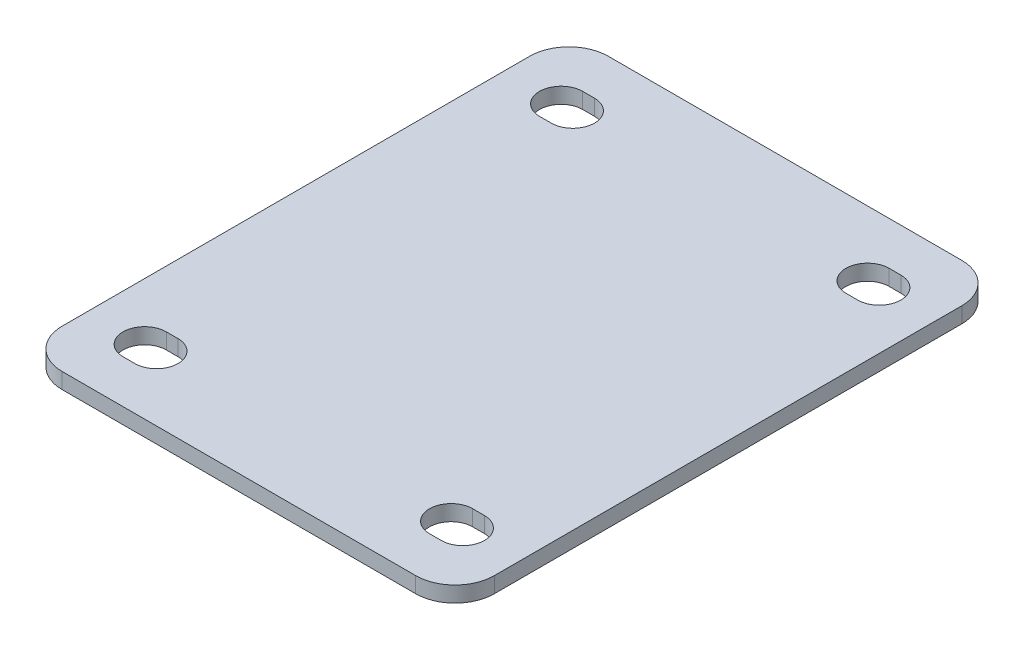
ISO-10303-21;
HEADER;
FILE_DESCRIPTION(('STEP AP214'),'2;1');
FILE_NAME('part.step','',(''),(''),'','','');
FILE_SCHEMA(('AUTOMOTIVE_DESIGN { 1 0 10303 214 1 1 1 1 }'));
ENDSEC;
DATA;
#1=APPLICATION_CONTEXT('core data for automotive mechanical design processes');
#2=APPLICATION_PROTOCOL_DEFINITION('international standard','automotive_design',2000,#1);
#3=PRODUCT_CONTEXT('',#1,'mechanical');
#4=PRODUCT('Part','Part','',(#3));
#5=PRODUCT_RELATED_PRODUCT_CATEGORY('part','',(#4));
#6=PRODUCT_DEFINITION_FORMATION('','',#4);
#7=PRODUCT_DEFINITION_CONTEXT('part definition',#1,'design');
#8=PRODUCT_DEFINITION('design','',#6,#7);
#9=PRODUCT_DEFINITION_SHAPE('','',#8);
#10=(LENGTH_UNIT() NAMED_UNIT(*) SI_UNIT(.MILLI.,.METRE.));
#11=(NAMED_UNIT(*) PLANE_ANGLE_UNIT() SI_UNIT($,.RADIAN.));
#12=(NAMED_UNIT(*) SI_UNIT($,.STERADIAN.) SOLID_ANGLE_UNIT());
#13=UNCERTAINTY_MEASURE_WITH_UNIT(LENGTH_MEASURE(1.E-05),#10,'distance_accuracy_value','');
#14=(GEOMETRIC_REPRESENTATION_CONTEXT(3) GLOBAL_UNCERTAINTY_ASSIGNED_CONTEXT((#13)) GLOBAL_UNIT_ASSIGNED_CONTEXT((#10,
#11,#12)) REPRESENTATION_CONTEXT('',''));
#15=CARTESIAN_POINT('',(0.,0.,0.));
#16=DIRECTION('',(0.,0.,1.));
#17=DIRECTION('',(1.,0.,0.));
#18=AXIS2_PLACEMENT_3D('',#15,#16,#17);
#19=CARTESIAN_POINT('',(0.,4.,0.));
#20=DIRECTION('',(0.,1.,0.));
#21=DIRECTION('',(0.,0.,1.));
#22=AXIS2_PLACEMENT_3D('',#19,#20,#21);
#23=PLANE('',#22);
#24=DIRECTION('',(-1.,0.,0.));
#25=VECTOR('',#24,1.);
#26=CARTESIAN_POINT('',(-55.,4.,-69.5));
#27=LINE('',#26,#25);
#28=CARTESIAN_POINT('',(45.,4.,-69.5));
#29=VERTEX_POINT('',#28);
#30=CARTESIAN_POINT('',(-45.,4.,-69.5));
#31=VERTEX_POINT('',#30);
#32=EDGE_CURVE('E334',#29,#31,#27,.T.);
#33=ORIENTED_EDGE('',*,*,#32,.T.);
#34=CARTESIAN_POINT('',(-45.,4.,-59.5));
#35=DIRECTION('',(0.,1.,0.));
#36=DIRECTION('',(0.,0.,1.));
#37=AXIS2_PLACEMENT_3D('',#34,#35,#36);
#38=CIRCLE('',#37,10.);
#39=CARTESIAN_POINT('',(-55.,4.,-59.5));
#40=VERTEX_POINT('',#39);
#41=EDGE_CURVE('E374',#31,#40,#38,.T.);
#42=ORIENTED_EDGE('',*,*,#41,.T.);
#43=DIRECTION('',(0.,0.,1.));
#44=VECTOR('',#43,1.);
#45=CARTESIAN_POINT('',(-55.,4.,-69.5));
#46=LINE('',#45,#44);
#47=CARTESIAN_POINT('',(-55.,4.,59.5));
#48=VERTEX_POINT('',#47);
#49=EDGE_CURVE('E338',#40,#48,#46,.T.);
#50=ORIENTED_EDGE('',*,*,#49,.T.);
#51=CARTESIAN_POINT('',(-45.,4.,59.5));
#52=DIRECTION('',(0.,1.,0.));
#53=DIRECTION('',(0.,0.,1.));
#54=AXIS2_PLACEMENT_3D('',#51,#52,#53);
#55=CIRCLE('',#54,10.);
#56=CARTESIAN_POINT('',(-45.,4.,69.5));
#57=VERTEX_POINT('',#56);
#58=EDGE_CURVE('E55',#48,#57,#55,.T.);
#59=ORIENTED_EDGE('',*,*,#58,.T.);
#60=DIRECTION('',(1.,0.,0.));
#61=VECTOR('',#60,1.);
#62=CARTESIAN_POINT('',(-55.,4.,69.5));
#63=LINE('',#62,#61);
#64=CARTESIAN_POINT('',(45.,4.,69.5));
#65=VERTEX_POINT('',#64);
#66=EDGE_CURVE('E340',#57,#65,#63,.T.);
#67=ORIENTED_EDGE('',*,*,#66,.T.);
#68=CARTESIAN_POINT('',(45.,4.,59.5));
#69=DIRECTION('',(0.,1.,0.));
#70=DIRECTION('',(0.,0.,1.));
#71=AXIS2_PLACEMENT_3D('',#68,#69,#70);
#72=CIRCLE('',#71,10.);
#73=CARTESIAN_POINT('',(55.,4.,59.5));
#74=VERTEX_POINT('',#73);
#75=EDGE_CURVE('E370',#65,#74,#72,.T.);
#76=ORIENTED_EDGE('',*,*,#75,.T.);
#77=DIRECTION('',(0.,0.,-1.));
#78=VECTOR('',#77,1.);
#79=CARTESIAN_POINT('',(55.,4.,-69.5));
#80=LINE('',#79,#78);
#81=CARTESIAN_POINT('',(55.,4.,-59.5));
#82=VERTEX_POINT('',#81);
#83=EDGE_CURVE('E331',#74,#82,#80,.T.);
#84=ORIENTED_EDGE('',*,*,#83,.T.);
#85=CARTESIAN_POINT('',(45.,4.,-59.5));
#86=DIRECTION('',(0.,1.,0.));
#87=DIRECTION('',(0.,0.,1.));
#88=AXIS2_PLACEMENT_3D('',#85,#86,#87);
#89=CIRCLE('',#88,10.);
#90=EDGE_CURVE('E372',#82,#29,#89,.T.);
#91=ORIENTED_EDGE('',*,*,#90,.T.);
#92=EDGE_LOOP('',(#33,#42,#50,#59,#67,#76,#84,#91));
#93=FACE_BOUND('',#92,.T.);
#94=DIRECTION('',(1.,0.,0.));
#95=VECTOR('',#94,1.);
#96=CARTESIAN_POINT('',(-40.5,4.,-47.5));
#97=LINE('',#96,#95);
#98=CARTESIAN_POINT('',(-40.5,4.,-47.5));
#99=VERTEX_POINT('',#98);
#100=CARTESIAN_POINT('',(-37.5,4.,-47.5));
#101=VERTEX_POINT('',#100);
#102=EDGE_CURVE('E302',#99,#101,#97,.T.);
#103=ORIENTED_EDGE('',*,*,#102,.F.);
#104=CARTESIAN_POINT('',(-40.5,4.,-53.));
#105=DIRECTION('',(0.,1.,0.));
#106=DIRECTION('',(0.,0.,1.));
#107=AXIS2_PLACEMENT_3D('',#104,#105,#106);
#108=CIRCLE('',#107,5.49999999999998);
#109=CARTESIAN_POINT('',(-40.5,4.,-58.5));
#110=VERTEX_POINT('',#109);
#111=EDGE_CURVE('E300',#110,#99,#108,.T.);
#112=ORIENTED_EDGE('',*,*,#111,.F.);
#113=DIRECTION('',(-1.,0.,0.));
#114=VECTOR('',#113,1.);
#115=CARTESIAN_POINT('',(-40.5,4.,-58.5));
#116=LINE('',#115,#114);
#117=CARTESIAN_POINT('',(-37.5,4.,-58.5));
#118=VERTEX_POINT('',#117);
#119=EDGE_CURVE('E308',#118,#110,#116,.T.);
#120=ORIENTED_EDGE('',*,*,#119,.F.);
#121=CARTESIAN_POINT('',(-37.5,4.,-53.));
#122=DIRECTION('',(0.,1.,0.));
#123=DIRECTION('',(0.,0.,1.));
#124=AXIS2_PLACEMENT_3D('',#121,#122,#123);
#125=CIRCLE('',#124,5.49999999999998);
#126=EDGE_CURVE('E305',#101,#118,#125,.T.);
#127=ORIENTED_EDGE('',*,*,#126,.F.);
#128=EDGE_LOOP('',(#103,#112,#120,#127));
#129=FACE_BOUND('',#128,.T.);
#130=DIRECTION('',(1.,0.,0.));
#131=VECTOR('',#130,1.);
#132=CARTESIAN_POINT('',(37.5,4.,-47.5));
#133=LINE('',#132,#131);
#134=CARTESIAN_POINT('',(37.5,4.,-47.5));
#135=VERTEX_POINT('',#134);
#136=CARTESIAN_POINT('',(40.5,4.,-47.5));
#137=VERTEX_POINT('',#136);
#138=EDGE_CURVE('E271',#135,#137,#133,.T.);
#139=ORIENTED_EDGE('',*,*,#138,.F.);
#140=CARTESIAN_POINT('',(37.5,4.,-53.));
#141=DIRECTION('',(0.,1.,0.));
#142=DIRECTION('',(0.,0.,1.));
#143=AXIS2_PLACEMENT_3D('',#140,#141,#142);
#144=CIRCLE('',#143,5.49999999999998);
#145=CARTESIAN_POINT('',(37.5,4.,-58.5));
#146=VERTEX_POINT('',#145);
#147=EDGE_CURVE('E269',#146,#135,#144,.T.);
#148=ORIENTED_EDGE('',*,*,#147,.F.);
#149=DIRECTION('',(-1.,0.,0.));
#150=VECTOR('',#149,1.);
#151=CARTESIAN_POINT('',(37.5,4.,-58.5));
#152=LINE('',#151,#150);
#153=CARTESIAN_POINT('',(40.5,4.,-58.5));
#154=VERTEX_POINT('',#153);
#155=EDGE_CURVE('E277',#154,#146,#152,.T.);
#156=ORIENTED_EDGE('',*,*,#155,.F.);
#157=CARTESIAN_POINT('',(40.5,4.,-53.));
#158=DIRECTION('',(0.,1.,0.));
#159=DIRECTION('',(0.,0.,1.));
#160=AXIS2_PLACEMENT_3D('',#157,#158,#159);
#161=CIRCLE('',#160,5.49999999999998);
#162=EDGE_CURVE('E274',#137,#154,#161,.T.);
#163=ORIENTED_EDGE('',*,*,#162,.F.);
#164=EDGE_LOOP('',(#139,#148,#156,#163));
#165=FACE_BOUND('',#164,.T.);
#166=DIRECTION('',(1.,0.,0.));
#167=VECTOR('',#166,1.);
#168=CARTESIAN_POINT('',(-40.4999999999989,4.,58.5));
#169=LINE('',#168,#167);
#170=CARTESIAN_POINT('',(-40.4999999999989,4.,58.5));
#171=VERTEX_POINT('',#170);
#172=CARTESIAN_POINT('',(-37.4999999999989,4.,58.5));
#173=VERTEX_POINT('',#172);
#174=EDGE_CURVE('E240',#171,#173,#169,.T.);
#175=ORIENTED_EDGE('',*,*,#174,.F.);
#176=CARTESIAN_POINT('',(-40.4999999999989,4.,53.));
#177=DIRECTION('',(0.,1.,0.));
#178=DIRECTION('',(0.,0.,1.));
#179=AXIS2_PLACEMENT_3D('',#176,#177,#178);
#180=CIRCLE('',#179,5.5);
#181=CARTESIAN_POINT('',(-40.4999999999989,4.,47.5));
#182=VERTEX_POINT('',#181);
#183=EDGE_CURVE('E238',#182,#171,#180,.T.);
#184=ORIENTED_EDGE('',*,*,#183,.F.);
#185=DIRECTION('',(-1.,0.,0.));
#186=VECTOR('',#185,1.);
#187=CARTESIAN_POINT('',(-40.4999999999989,4.,47.5));
#188=LINE('',#187,#186);
#189=CARTESIAN_POINT('',(-37.4999999999989,4.,47.5));
#190=VERTEX_POINT('',#189);
#191=EDGE_CURVE('E246',#190,#182,#188,.T.);
#192=ORIENTED_EDGE('',*,*,#191,.F.);
#193=CARTESIAN_POINT('',(-37.4999999999989,4.,53.));
#194=DIRECTION('',(0.,1.,0.));
#195=DIRECTION('',(0.,0.,1.));
#196=AXIS2_PLACEMENT_3D('',#193,#194,#195);
#197=CIRCLE('',#196,5.5);
#198=EDGE_CURVE('E243',#173,#190,#197,.T.);
#199=ORIENTED_EDGE('',*,*,#198,.F.);
#200=EDGE_LOOP('',(#175,#184,#192,#199));
#201=FACE_BOUND('',#200,.T.);
#202=DIRECTION('',(1.,0.,0.));
#203=VECTOR('',#202,1.);
#204=CARTESIAN_POINT('',(37.5000000000011,4.,58.5));
#205=LINE('',#204,#203);
#206=CARTESIAN_POINT('',(37.5000000000011,4.,58.5));
#207=VERTEX_POINT('',#206);
#208=CARTESIAN_POINT('',(40.5000000000011,4.,58.5));
#209=VERTEX_POINT('',#208);
#210=EDGE_CURVE('E207',#207,#209,#205,.T.);
#211=ORIENTED_EDGE('',*,*,#210,.F.);
#212=CARTESIAN_POINT('',(37.5000000000011,4.,53.));
#213=DIRECTION('',(0.,1.,0.));
#214=DIRECTION('',(0.,0.,1.));
#215=AXIS2_PLACEMENT_3D('',#212,#213,#214);
#216=CIRCLE('',#215,5.5);
#217=CARTESIAN_POINT('',(37.5000000000011,4.,47.5));
#218=VERTEX_POINT('',#217);
#219=EDGE_CURVE('E197',#218,#207,#216,.T.);
#220=ORIENTED_EDGE('',*,*,#219,.F.);
#221=DIRECTION('',(-1.,0.,0.));
#222=VECTOR('',#221,1.);
#223=CARTESIAN_POINT('',(37.5000000000011,4.,47.5));
#224=LINE('',#223,#222);
#225=CARTESIAN_POINT('',(40.5000000000011,4.,47.5));
#226=VERTEX_POINT('',#225);
#227=EDGE_CURVE('E222',#226,#218,#224,.T.);
#228=ORIENTED_EDGE('',*,*,#227,.F.);
#229=CARTESIAN_POINT('',(40.5000000000011,4.,53.));
#230=DIRECTION('',(0.,1.,0.));
#231=DIRECTION('',(0.,0.,1.));
#232=AXIS2_PLACEMENT_3D('',#229,#230,#231);
#233=CIRCLE('',#232,5.5);
#234=EDGE_CURVE('E220',#209,#226,#233,.T.);
#235=ORIENTED_EDGE('',*,*,#234,.F.);
#236=EDGE_LOOP('',(#211,#220,#228,#235));
#237=FACE_BOUND('',#236,.T.);
#238=ADVANCED_FACE('F35',(#93,#129,#165,#201,#237),#23,.T.);
#239=CARTESIAN_POINT('',(0.,0.,0.));
#240=DIRECTION('',(0.,1.,0.));
#241=DIRECTION('',(0.,0.,1.));
#242=AXIS2_PLACEMENT_3D('',#239,#240,#241);
#243=PLANE('',#242);
#244=CARTESIAN_POINT('',(-40.4999999999989,0.,53.));
#245=DIRECTION('',(0.,1.,0.));
#246=DIRECTION('',(0.,0.,1.));
#247=AXIS2_PLACEMENT_3D('',#244,#245,#246);
#248=CIRCLE('',#247,5.5);
#249=CARTESIAN_POINT('',(-40.4999999999989,0.,47.5));
#250=VERTEX_POINT('',#249);
#251=CARTESIAN_POINT('',(-40.4999999999989,0.,58.5));
#252=VERTEX_POINT('',#251);
#253=EDGE_CURVE('E215',#250,#252,#248,.T.);
#254=ORIENTED_EDGE('',*,*,#253,.T.);
#255=DIRECTION('',(1.,0.,0.));
#256=VECTOR('',#255,1.);
#257=CARTESIAN_POINT('',(-40.4999999999989,0.,58.5));
#258=LINE('',#257,#256);
#259=CARTESIAN_POINT('',(-37.4999999999989,0.,58.5));
#260=VERTEX_POINT('',#259);
#261=EDGE_CURVE('E251',#252,#260,#258,.T.);
#262=ORIENTED_EDGE('',*,*,#261,.T.);
#263=CARTESIAN_POINT('',(-37.4999999999989,0.,53.));
#264=DIRECTION('',(0.,1.,0.));
#265=DIRECTION('',(0.,0.,1.));
#266=AXIS2_PLACEMENT_3D('',#263,#264,#265);
#267=CIRCLE('',#266,5.5);
#268=CARTESIAN_POINT('',(-37.4999999999989,0.,47.5));
#269=VERTEX_POINT('',#268);
#270=EDGE_CURVE('E254',#260,#269,#267,.T.);
#271=ORIENTED_EDGE('',*,*,#270,.T.);
#272=DIRECTION('',(-1.,0.,0.));
#273=VECTOR('',#272,1.);
#274=CARTESIAN_POINT('',(-40.4999999999989,0.,47.5));
#275=LINE('',#274,#273);
#276=EDGE_CURVE('E241',#269,#250,#275,.T.);
#277=ORIENTED_EDGE('',*,*,#276,.T.);
#278=EDGE_LOOP('',(#254,#262,#271,#277));
#279=FACE_BOUND('',#278,.T.);
#280=CARTESIAN_POINT('',(-40.5,0.,-53.));
#281=DIRECTION('',(0.,1.,0.));
#282=DIRECTION('',(0.,0.,1.));
#283=AXIS2_PLACEMENT_3D('',#280,#281,#282);
#284=CIRCLE('',#283,5.49999999999998);
#285=CARTESIAN_POINT('',(-40.5,0.,-58.5));
#286=VERTEX_POINT('',#285);
#287=CARTESIAN_POINT('',(-40.5,0.,-47.5));
#288=VERTEX_POINT('',#287);
#289=EDGE_CURVE('E299',#286,#288,#284,.T.);
#290=ORIENTED_EDGE('',*,*,#289,.T.);
#291=DIRECTION('',(1.,0.,0.));
#292=VECTOR('',#291,1.);
#293=CARTESIAN_POINT('',(-40.5,0.,-47.5));
#294=LINE('',#293,#292);
#295=CARTESIAN_POINT('',(-37.5,0.,-47.5));
#296=VERTEX_POINT('',#295);
#297=EDGE_CURVE('E313',#288,#296,#294,.T.);
#298=ORIENTED_EDGE('',*,*,#297,.T.);
#299=CARTESIAN_POINT('',(-37.5,0.,-53.));
#300=DIRECTION('',(0.,1.,0.));
#301=DIRECTION('',(0.,0.,1.));
#302=AXIS2_PLACEMENT_3D('',#299,#300,#301);
#303=CIRCLE('',#302,5.49999999999998);
#304=CARTESIAN_POINT('',(-37.5,0.,-58.5));
#305=VERTEX_POINT('',#304);
#306=EDGE_CURVE('E316',#296,#305,#303,.T.);
#307=ORIENTED_EDGE('',*,*,#306,.T.);
#308=DIRECTION('',(-1.,0.,0.));
#309=VECTOR('',#308,1.);
#310=CARTESIAN_POINT('',(-40.5,0.,-58.5));
#311=LINE('',#310,#309);
#312=EDGE_CURVE('E303',#305,#286,#311,.T.);
#313=ORIENTED_EDGE('',*,*,#312,.T.);
#314=EDGE_LOOP('',(#290,#298,#307,#313));
#315=FACE_BOUND('',#314,.T.);
#316=DIRECTION('',(0.,0.,1.));
#317=VECTOR('',#316,1.);
#318=CARTESIAN_POINT('',(-55.,0.,-69.5));
#319=LINE('',#318,#317);
#320=CARTESIAN_POINT('',(-55.,0.,-59.5));
#321=VERTEX_POINT('',#320);
#322=CARTESIAN_POINT('',(-55.,0.,59.5));
#323=VERTEX_POINT('',#322);
#324=EDGE_CURVE('E348',#321,#323,#319,.T.);
#325=ORIENTED_EDGE('',*,*,#324,.F.);
#326=CARTESIAN_POINT('',(-45.,0.,-59.5));
#327=DIRECTION('',(0.,1.,0.));
#328=DIRECTION('',(0.,0.,1.));
#329=AXIS2_PLACEMENT_3D('',#326,#327,#328);
#330=CIRCLE('',#329,10.);
#331=CARTESIAN_POINT('',(-45.,0.,-69.5));
#332=VERTEX_POINT('',#331);
#333=EDGE_CURVE('E362',#321,#332,#330,.F.);
#334=ORIENTED_EDGE('',*,*,#333,.T.);
#335=DIRECTION('',(-1.,0.,0.));
#336=VECTOR('',#335,1.);
#337=CARTESIAN_POINT('',(-55.,0.,-69.5));
#338=LINE('',#337,#336);
#339=CARTESIAN_POINT('',(45.,0.,-69.5));
#340=VERTEX_POINT('',#339);
#341=EDGE_CURVE('E345',#340,#332,#338,.T.);
#342=ORIENTED_EDGE('',*,*,#341,.F.);
#343=CARTESIAN_POINT('',(45.,0.,-59.5));
#344=DIRECTION('',(0.,1.,0.));
#345=DIRECTION('',(0.,0.,1.));
#346=AXIS2_PLACEMENT_3D('',#343,#344,#345);
#347=CIRCLE('',#346,10.);
#348=CARTESIAN_POINT('',(55.,0.,-59.5));
#349=VERTEX_POINT('',#348);
#350=EDGE_CURVE('E360',#340,#349,#347,.F.);
#351=ORIENTED_EDGE('',*,*,#350,.T.);
#352=DIRECTION('',(0.,0.,-1.));
#353=VECTOR('',#352,1.);
#354=CARTESIAN_POINT('',(55.,0.,-69.5));
#355=LINE('',#354,#353);
#356=CARTESIAN_POINT('',(55.,0.,59.5));
#357=VERTEX_POINT('',#356);
#358=EDGE_CURVE('E330',#357,#349,#355,.T.);
#359=ORIENTED_EDGE('',*,*,#358,.F.);
#360=CARTESIAN_POINT('',(45.,0.,59.5));
#361=DIRECTION('',(0.,1.,0.));
#362=DIRECTION('',(0.,0.,1.));
#363=AXIS2_PLACEMENT_3D('',#360,#361,#362);
#364=CIRCLE('',#363,10.);
#365=CARTESIAN_POINT('',(45.,0.,69.5));
#366=VERTEX_POINT('',#365);
#367=EDGE_CURVE('E358',#357,#366,#364,.F.);
#368=ORIENTED_EDGE('',*,*,#367,.T.);
#369=DIRECTION('',(1.,0.,0.));
#370=VECTOR('',#369,1.);
#371=CARTESIAN_POINT('',(-55.,0.,69.5));
#372=LINE('',#371,#370);
#373=CARTESIAN_POINT('',(-45.,0.,69.5));
#374=VERTEX_POINT('',#373);
#375=EDGE_CURVE('E335',#374,#366,#372,.T.);
#376=ORIENTED_EDGE('',*,*,#375,.F.);
#377=CARTESIAN_POINT('',(-45.,0.,59.5));
#378=DIRECTION('',(0.,1.,0.));
#379=DIRECTION('',(0.,0.,1.));
#380=AXIS2_PLACEMENT_3D('',#377,#378,#379);
#381=CIRCLE('',#380,10.);
#382=EDGE_CURVE('E356',#374,#323,#381,.F.);
#383=ORIENTED_EDGE('',*,*,#382,.T.);
#384=EDGE_LOOP('',(#325,#334,#342,#351,#359,#368,#376,#383));
#385=FACE_BOUND('',#384,.T.);
#386=CARTESIAN_POINT('',(37.5,0.,-53.));
#387=DIRECTION('',(0.,1.,0.));
#388=DIRECTION('',(0.,0.,1.));
#389=AXIS2_PLACEMENT_3D('',#386,#387,#388);
#390=CIRCLE('',#389,5.49999999999998);
#391=CARTESIAN_POINT('',(37.5,0.,-58.5));
#392=VERTEX_POINT('',#391);
#393=CARTESIAN_POINT('',(37.5,0.,-47.5));
#394=VERTEX_POINT('',#393);
#395=EDGE_CURVE('E268',#392,#394,#390,.T.);
#396=ORIENTED_EDGE('',*,*,#395,.T.);
#397=DIRECTION('',(1.,0.,0.));
#398=VECTOR('',#397,1.);
#399=CARTESIAN_POINT('',(37.5,0.,-47.5));
#400=LINE('',#399,#398);
#401=CARTESIAN_POINT('',(40.5,0.,-47.5));
#402=VERTEX_POINT('',#401);
#403=EDGE_CURVE('E282',#394,#402,#400,.T.);
#404=ORIENTED_EDGE('',*,*,#403,.T.);
#405=CARTESIAN_POINT('',(40.5,0.,-53.));
#406=DIRECTION('',(0.,1.,0.));
#407=DIRECTION('',(0.,0.,1.));
#408=AXIS2_PLACEMENT_3D('',#405,#406,#407);
#409=CIRCLE('',#408,5.49999999999998);
#410=CARTESIAN_POINT('',(40.5,0.,-58.5));
#411=VERTEX_POINT('',#410);
#412=EDGE_CURVE('E285',#402,#411,#409,.T.);
#413=ORIENTED_EDGE('',*,*,#412,.T.);
#414=DIRECTION('',(-1.,0.,0.));
#415=VECTOR('',#414,1.);
#416=CARTESIAN_POINT('',(37.5,0.,-58.5));
#417=LINE('',#416,#415);
#418=EDGE_CURVE('E272',#411,#392,#417,.T.);
#419=ORIENTED_EDGE('',*,*,#418,.T.);
#420=EDGE_LOOP('',(#396,#404,#413,#419));
#421=FACE_BOUND('',#420,.T.);
#422=CARTESIAN_POINT('',(37.5000000000011,0.,53.));
#423=DIRECTION('',(0.,1.,0.));
#424=DIRECTION('',(0.,0.,1.));
#425=AXIS2_PLACEMENT_3D('',#422,#423,#424);
#426=CIRCLE('',#425,5.5);
#427=CARTESIAN_POINT('',(37.5000000000011,0.,47.5));
#428=VERTEX_POINT('',#427);
#429=CARTESIAN_POINT('',(37.5000000000011,0.,58.5));
#430=VERTEX_POINT('',#429);
#431=EDGE_CURVE('E226',#428,#430,#426,.T.);
#432=ORIENTED_EDGE('',*,*,#431,.T.);
#433=DIRECTION('',(1.,0.,0.));
#434=VECTOR('',#433,1.);
#435=CARTESIAN_POINT('',(37.5000000000011,0.,58.5));
#436=LINE('',#435,#434);
#437=CARTESIAN_POINT('',(40.5000000000011,0.,58.5));
#438=VERTEX_POINT('',#437);
#439=EDGE_CURVE('E214',#430,#438,#436,.T.);
#440=ORIENTED_EDGE('',*,*,#439,.T.);
#441=CARTESIAN_POINT('',(40.5000000000011,0.,53.));
#442=DIRECTION('',(0.,1.,0.));
#443=DIRECTION('',(0.,0.,1.));
#444=AXIS2_PLACEMENT_3D('',#441,#442,#443);
#445=CIRCLE('',#444,5.5);
#446=CARTESIAN_POINT('',(40.5000000000011,0.,47.5));
#447=VERTEX_POINT('',#446);
#448=EDGE_CURVE('E229',#438,#447,#445,.T.);
#449=ORIENTED_EDGE('',*,*,#448,.T.);
#450=DIRECTION('',(-1.,0.,0.));
#451=VECTOR('',#450,1.);
#452=CARTESIAN_POINT('',(37.5000000000011,0.,47.5));
#453=LINE('',#452,#451);
#454=EDGE_CURVE('E208',#447,#428,#453,.T.);
#455=ORIENTED_EDGE('',*,*,#454,.T.);
#456=EDGE_LOOP('',(#432,#440,#449,#455));
#457=FACE_BOUND('',#456,.T.);
#458=ADVANCED_FACE('F387',(#279,#315,#385,#421,#457),#243,.F.);
#459=CARTESIAN_POINT('',(55.,4.,-69.5));
#460=DIRECTION('',(-1.,0.,0.));
#461=DIRECTION('',(0.,0.,1.));
#462=AXIS2_PLACEMENT_3D('',#459,#460,#461);
#463=PLANE('',#462);
#464=ORIENTED_EDGE('',*,*,#358,.T.);
#465=DIRECTION('',(0.,-1.,0.));
#466=VECTOR('',#465,1.);
#467=CARTESIAN_POINT('',(55.,4.,-59.5));
#468=LINE('',#467,#466);
#469=EDGE_CURVE('E379',#349,#82,#468,.F.);
#470=ORIENTED_EDGE('',*,*,#469,.T.);
#471=ORIENTED_EDGE('',*,*,#83,.F.);
#472=DIRECTION('',(0.,-1.,0.));
#473=VECTOR('',#472,1.);
#474=CARTESIAN_POINT('',(55.,4.,59.5));
#475=LINE('',#474,#473);
#476=EDGE_CURVE('E376',#74,#357,#475,.T.);
#477=ORIENTED_EDGE('',*,*,#476,.T.);
#478=EDGE_LOOP('',(#464,#470,#471,#477));
#479=FACE_BOUND('',#478,.T.);
#480=ADVANCED_FACE('F396',(#479),#463,.F.);
#481=CARTESIAN_POINT('',(-55.,4.,-69.5));
#482=DIRECTION('',(0.,0.,1.));
#483=DIRECTION('',(1.,0.,0.));
#484=AXIS2_PLACEMENT_3D('',#481,#482,#483);
#485=PLANE('',#484);
#486=ORIENTED_EDGE('',*,*,#341,.T.);
#487=DIRECTION('',(0.,-1.,0.));
#488=VECTOR('',#487,1.);
#489=CARTESIAN_POINT('',(-45.,4.,-69.5));
#490=LINE('',#489,#488);
#491=EDGE_CURVE('E367',#332,#31,#490,.F.);
#492=ORIENTED_EDGE('',*,*,#491,.T.);
#493=ORIENTED_EDGE('',*,*,#32,.F.);
#494=DIRECTION('',(0.,-1.,0.));
#495=VECTOR('',#494,1.);
#496=CARTESIAN_POINT('',(45.,4.,-69.5));
#497=LINE('',#496,#495);
#498=EDGE_CURVE('E364',#29,#340,#497,.T.);
#499=ORIENTED_EDGE('',*,*,#498,.T.);
#500=EDGE_LOOP('',(#486,#492,#493,#499));
#501=FACE_BOUND('',#500,.T.);
#502=ADVANCED_FACE('F406',(#501),#485,.F.);
#503=CARTESIAN_POINT('',(-55.,4.,-69.5));
#504=DIRECTION('',(1.,0.,0.));
#505=DIRECTION('',(0.,0.,-1.));
#506=AXIS2_PLACEMENT_3D('',#503,#504,#505);
#507=PLANE('',#506);
#508=ORIENTED_EDGE('',*,*,#49,.F.);
#509=DIRECTION('',(0.,-1.,0.));
#510=VECTOR('',#509,1.);
#511=CARTESIAN_POINT('',(-55.,4.,-59.5));
#512=LINE('',#511,#510);
#513=EDGE_CURVE('E353',#40,#321,#512,.T.);
#514=ORIENTED_EDGE('',*,*,#513,.T.);
#515=ORIENTED_EDGE('',*,*,#324,.T.);
#516=DIRECTION('',(0.,-1.,0.));
#517=VECTOR('',#516,1.);
#518=CARTESIAN_POINT('',(-55.,4.,59.5));
#519=LINE('',#518,#517);
#520=EDGE_CURVE('E342',#323,#48,#519,.F.);
#521=ORIENTED_EDGE('',*,*,#520,.T.);
#522=EDGE_LOOP('',(#508,#514,#515,#521));
#523=FACE_BOUND('',#522,.T.);
#524=ADVANCED_FACE('F414',(#523),#507,.F.);
#525=CARTESIAN_POINT('',(-55.,4.,69.5));
#526=DIRECTION('',(0.,0.,-1.));
#527=DIRECTION('',(-1.,0.,0.));
#528=AXIS2_PLACEMENT_3D('',#525,#526,#527);
#529=PLANE('',#528);
#530=ORIENTED_EDGE('',*,*,#375,.T.);
#531=DIRECTION('',(0.,-1.,0.));
#532=VECTOR('',#531,1.);
#533=CARTESIAN_POINT('',(45.,4.,69.5));
#534=LINE('',#533,#532);
#535=EDGE_CURVE('E11',#366,#65,#534,.F.);
#536=ORIENTED_EDGE('',*,*,#535,.T.);
#537=ORIENTED_EDGE('',*,*,#66,.F.);
#538=DIRECTION('',(0.,-1.,0.));
#539=VECTOR('',#538,1.);
#540=CARTESIAN_POINT('',(-45.,4.,69.5));
#541=LINE('',#540,#539);
#542=EDGE_CURVE('E43',#57,#374,#541,.T.);
#543=ORIENTED_EDGE('',*,*,#542,.T.);
#544=EDGE_LOOP('',(#530,#536,#537,#543));
#545=FACE_BOUND('',#544,.T.);
#546=ADVANCED_FACE('F383',(#545),#529,.F.);
#547=CARTESIAN_POINT('',(-40.5,4.,-53.));
#548=DIRECTION('',(0.,-1.,0.));
#549=DIRECTION('',(0.,0.,-1.));
#550=AXIS2_PLACEMENT_3D('',#547,#548,#549);
#551=CYLINDRICAL_SURFACE('',#550,5.49999999999998);
#552=ORIENTED_EDGE('',*,*,#289,.F.);
#553=DIRECTION('',(0.,-1.,0.));
#554=VECTOR('',#553,1.);
#555=CARTESIAN_POINT('',(-40.5,4.,-58.5));
#556=LINE('',#555,#554);
#557=EDGE_CURVE('E310',#110,#286,#556,.T.);
#558=ORIENTED_EDGE('',*,*,#557,.F.);
#559=ORIENTED_EDGE('',*,*,#111,.T.);
#560=DIRECTION('',(0.,-1.,0.));
#561=VECTOR('',#560,1.);
#562=CARTESIAN_POINT('',(-40.5,4.,-47.5));
#563=LINE('',#562,#561);
#564=EDGE_CURVE('E327',#99,#288,#563,.T.);
#565=ORIENTED_EDGE('',*,*,#564,.T.);
#566=EDGE_LOOP('',(#552,#558,#559,#565));
#567=FACE_BOUND('',#566,.T.);
#568=ADVANCED_FACE('F428',(#567),#551,.F.);
#569=CARTESIAN_POINT('',(-40.5,4.,-47.5));
#570=DIRECTION('',(0.,0.,-1.));
#571=DIRECTION('',(-1.,0.,0.));
#572=AXIS2_PLACEMENT_3D('',#569,#570,#571);
#573=PLANE('',#572);
#574=ORIENTED_EDGE('',*,*,#297,.F.);
#575=ORIENTED_EDGE('',*,*,#564,.F.);
#576=ORIENTED_EDGE('',*,*,#102,.T.);
#577=DIRECTION('',(0.,-1.,0.));
#578=VECTOR('',#577,1.);
#579=CARTESIAN_POINT('',(-37.5,4.,-47.5));
#580=LINE('',#579,#578);
#581=EDGE_CURVE('E325',#101,#296,#580,.T.);
#582=ORIENTED_EDGE('',*,*,#581,.T.);
#583=EDGE_LOOP('',(#574,#575,#576,#582));
#584=FACE_BOUND('',#583,.T.);
#585=ADVANCED_FACE('F585',(#584),#573,.T.);
#586=CARTESIAN_POINT('',(-37.5,4.,-53.));
#587=DIRECTION('',(0.,-1.,0.));
#588=DIRECTION('',(0.,0.,-1.));
#589=AXIS2_PLACEMENT_3D('',#586,#587,#588);
#590=CYLINDRICAL_SURFACE('',#589,5.49999999999998);
#591=ORIENTED_EDGE('',*,*,#306,.F.);
#592=ORIENTED_EDGE('',*,*,#581,.F.);
#593=ORIENTED_EDGE('',*,*,#126,.T.);
#594=DIRECTION('',(0.,-1.,0.));
#595=VECTOR('',#594,1.);
#596=CARTESIAN_POINT('',(-37.5,4.,-58.5));
#597=LINE('',#596,#595);
#598=EDGE_CURVE('E323',#118,#305,#597,.T.);
#599=ORIENTED_EDGE('',*,*,#598,.T.);
#600=EDGE_LOOP('',(#591,#592,#593,#599));
#601=FACE_BOUND('',#600,.T.);
#602=ADVANCED_FACE('F576',(#601),#590,.F.);
#603=CARTESIAN_POINT('',(-40.5,4.,-58.5));
#604=DIRECTION('',(0.,0.,1.));
#605=DIRECTION('',(1.,0.,0.));
#606=AXIS2_PLACEMENT_3D('',#603,#604,#605);
#607=PLANE('',#606);
#608=ORIENTED_EDGE('',*,*,#312,.F.);
#609=ORIENTED_EDGE('',*,*,#598,.F.);
#610=ORIENTED_EDGE('',*,*,#119,.T.);
#611=ORIENTED_EDGE('',*,*,#557,.T.);
#612=EDGE_LOOP('',(#608,#609,#610,#611));
#613=FACE_BOUND('',#612,.T.);
#614=ADVANCED_FACE('F567',(#613),#607,.T.);
#615=CARTESIAN_POINT('',(37.5,4.,-53.));
#616=DIRECTION('',(0.,-1.,0.));
#617=DIRECTION('',(0.,0.,-1.));
#618=AXIS2_PLACEMENT_3D('',#615,#616,#617);
#619=CYLINDRICAL_SURFACE('',#618,5.49999999999998);
#620=ORIENTED_EDGE('',*,*,#395,.F.);
#621=DIRECTION('',(0.,-1.,0.));
#622=VECTOR('',#621,1.);
#623=CARTESIAN_POINT('',(37.5,4.,-58.5));
#624=LINE('',#623,#622);
#625=EDGE_CURVE('E279',#146,#392,#624,.T.);
#626=ORIENTED_EDGE('',*,*,#625,.F.);
#627=ORIENTED_EDGE('',*,*,#147,.T.);
#628=DIRECTION('',(0.,-1.,0.));
#629=VECTOR('',#628,1.);
#630=CARTESIAN_POINT('',(37.5,4.,-47.5));
#631=LINE('',#630,#629);
#632=EDGE_CURVE('E296',#135,#394,#631,.T.);
#633=ORIENTED_EDGE('',*,*,#632,.T.);
#634=EDGE_LOOP('',(#620,#626,#627,#633));
#635=FACE_BOUND('',#634,.T.);
#636=ADVANCED_FACE('F558',(#635),#619,.F.);
#637=CARTESIAN_POINT('',(37.5,4.,-47.5));
#638=DIRECTION('',(0.,0.,-1.));
#639=DIRECTION('',(-1.,0.,0.));
#640=AXIS2_PLACEMENT_3D('',#637,#638,#639);
#641=PLANE('',#640);
#642=ORIENTED_EDGE('',*,*,#403,.F.);
#643=ORIENTED_EDGE('',*,*,#632,.F.);
#644=ORIENTED_EDGE('',*,*,#138,.T.);
#645=DIRECTION('',(0.,-1.,0.));
#646=VECTOR('',#645,1.);
#647=CARTESIAN_POINT('',(40.5,4.,-47.5));
#648=LINE('',#647,#646);
#649=EDGE_CURVE('E294',#137,#402,#648,.T.);
#650=ORIENTED_EDGE('',*,*,#649,.T.);
#651=EDGE_LOOP('',(#642,#643,#644,#650));
#652=FACE_BOUND('',#651,.T.);
#653=ADVANCED_FACE('F549',(#652),#641,.T.);
#654=CARTESIAN_POINT('',(40.5,4.,-53.));
#655=DIRECTION('',(0.,-1.,0.));
#656=DIRECTION('',(0.,0.,-1.));
#657=AXIS2_PLACEMENT_3D('',#654,#655,#656);
#658=CYLINDRICAL_SURFACE('',#657,5.49999999999998);
#659=ORIENTED_EDGE('',*,*,#412,.F.);
#660=ORIENTED_EDGE('',*,*,#649,.F.);
#661=ORIENTED_EDGE('',*,*,#162,.T.);
#662=DIRECTION('',(0.,-1.,0.));
#663=VECTOR('',#662,1.);
#664=CARTESIAN_POINT('',(40.5,4.,-58.5));
#665=LINE('',#664,#663);
#666=EDGE_CURVE('E292',#154,#411,#665,.T.);
#667=ORIENTED_EDGE('',*,*,#666,.T.);
#668=EDGE_LOOP('',(#659,#660,#661,#667));
#669=FACE_BOUND('',#668,.T.);
#670=ADVANCED_FACE('F540',(#669),#658,.F.);
#671=CARTESIAN_POINT('',(37.5,4.,-58.5));
#672=DIRECTION('',(0.,0.,1.));
#673=DIRECTION('',(1.,0.,0.));
#674=AXIS2_PLACEMENT_3D('',#671,#672,#673);
#675=PLANE('',#674);
#676=ORIENTED_EDGE('',*,*,#418,.F.);
#677=ORIENTED_EDGE('',*,*,#666,.F.);
#678=ORIENTED_EDGE('',*,*,#155,.T.);
#679=ORIENTED_EDGE('',*,*,#625,.T.);
#680=EDGE_LOOP('',(#676,#677,#678,#679));
#681=FACE_BOUND('',#680,.T.);
#682=ADVANCED_FACE('F531',(#681),#675,.T.);
#683=CARTESIAN_POINT('',(-40.4999999999989,4.,53.));
#684=DIRECTION('',(0.,-1.,0.));
#685=DIRECTION('',(0.,0.,-1.));
#686=AXIS2_PLACEMENT_3D('',#683,#684,#685);
#687=CYLINDRICAL_SURFACE('',#686,5.5);
#688=ORIENTED_EDGE('',*,*,#253,.F.);
#689=DIRECTION('',(0.,-1.,0.));
#690=VECTOR('',#689,1.);
#691=CARTESIAN_POINT('',(-40.4999999999989,4.,47.5));
#692=LINE('',#691,#690);
#693=EDGE_CURVE('E248',#182,#250,#692,.T.);
#694=ORIENTED_EDGE('',*,*,#693,.F.);
#695=ORIENTED_EDGE('',*,*,#183,.T.);
#696=DIRECTION('',(0.,-1.,0.));
#697=VECTOR('',#696,1.);
#698=CARTESIAN_POINT('',(-40.4999999999989,4.,58.5));
#699=LINE('',#698,#697);
#700=EDGE_CURVE('E265',#171,#252,#699,.T.);
#701=ORIENTED_EDGE('',*,*,#700,.T.);
#702=EDGE_LOOP('',(#688,#694,#695,#701));
#703=FACE_BOUND('',#702,.T.);
#704=ADVANCED_FACE('F522',(#703),#687,.F.);
#705=CARTESIAN_POINT('',(-40.4999999999989,4.,58.5));
#706=DIRECTION('',(0.,0.,-1.));
#707=DIRECTION('',(-1.,0.,0.));
#708=AXIS2_PLACEMENT_3D('',#705,#706,#707);
#709=PLANE('',#708);
#710=ORIENTED_EDGE('',*,*,#261,.F.);
#711=ORIENTED_EDGE('',*,*,#700,.F.);
#712=ORIENTED_EDGE('',*,*,#174,.T.);
#713=DIRECTION('',(0.,-1.,0.));
#714=VECTOR('',#713,1.);
#715=CARTESIAN_POINT('',(-37.4999999999989,4.,58.5));
#716=LINE('',#715,#714);
#717=EDGE_CURVE('E263',#173,#260,#716,.T.);
#718=ORIENTED_EDGE('',*,*,#717,.T.);
#719=EDGE_LOOP('',(#710,#711,#712,#718));
#720=FACE_BOUND('',#719,.T.);
#721=ADVANCED_FACE('F513',(#720),#709,.T.);
#722=CARTESIAN_POINT('',(-37.4999999999989,4.,53.));
#723=DIRECTION('',(0.,-1.,0.));
#724=DIRECTION('',(0.,0.,-1.));
#725=AXIS2_PLACEMENT_3D('',#722,#723,#724);
#726=CYLINDRICAL_SURFACE('',#725,5.5);
#727=ORIENTED_EDGE('',*,*,#270,.F.);
#728=ORIENTED_EDGE('',*,*,#717,.F.);
#729=ORIENTED_EDGE('',*,*,#198,.T.);
#730=DIRECTION('',(0.,-1.,0.));
#731=VECTOR('',#730,1.);
#732=CARTESIAN_POINT('',(-37.4999999999989,4.,47.5));
#733=LINE('',#732,#731);
#734=EDGE_CURVE('E261',#190,#269,#733,.T.);
#735=ORIENTED_EDGE('',*,*,#734,.T.);
#736=EDGE_LOOP('',(#727,#728,#729,#735));
#737=FACE_BOUND('',#736,.T.);
#738=ADVANCED_FACE('F504',(#737),#726,.F.);
#739=CARTESIAN_POINT('',(-40.4999999999989,4.,47.5));
#740=DIRECTION('',(0.,0.,1.));
#741=DIRECTION('',(1.,0.,0.));
#742=AXIS2_PLACEMENT_3D('',#739,#740,#741);
#743=PLANE('',#742);
#744=ORIENTED_EDGE('',*,*,#276,.F.);
#745=ORIENTED_EDGE('',*,*,#734,.F.);
#746=ORIENTED_EDGE('',*,*,#191,.T.);
#747=ORIENTED_EDGE('',*,*,#693,.T.);
#748=EDGE_LOOP('',(#744,#745,#746,#747));
#749=FACE_BOUND('',#748,.T.);
#750=ADVANCED_FACE('F496',(#749),#743,.T.);
#751=CARTESIAN_POINT('',(37.5000000000011,4.,53.));
#752=DIRECTION('',(0.,-1.,0.));
#753=DIRECTION('',(0.,0.,-1.));
#754=AXIS2_PLACEMENT_3D('',#751,#752,#753);
#755=CYLINDRICAL_SURFACE('',#754,5.5);
#756=ORIENTED_EDGE('',*,*,#431,.F.);
#757=DIRECTION('',(0.,-1.,0.));
#758=VECTOR('',#757,1.);
#759=CARTESIAN_POINT('',(37.5000000000011,4.,47.5));
#760=LINE('',#759,#758);
#761=EDGE_CURVE('E203',#218,#428,#760,.T.);
#762=ORIENTED_EDGE('',*,*,#761,.F.);
#763=ORIENTED_EDGE('',*,*,#219,.T.);
#764=DIRECTION('',(0.,-1.,0.));
#765=VECTOR('',#764,1.);
#766=CARTESIAN_POINT('',(37.5000000000011,4.,58.5));
#767=LINE('',#766,#765);
#768=EDGE_CURVE('E200',#207,#430,#767,.T.);
#769=ORIENTED_EDGE('',*,*,#768,.T.);
#770=EDGE_LOOP('',(#756,#762,#763,#769));
#771=FACE_BOUND('',#770,.T.);
#772=ADVANCED_FACE('F199',(#771),#755,.F.);
#773=CARTESIAN_POINT('',(37.5000000000011,4.,58.5));
#774=DIRECTION('',(0.,0.,-1.));
#775=DIRECTION('',(-1.,0.,0.));
#776=AXIS2_PLACEMENT_3D('',#773,#774,#775);
#777=PLANE('',#776);
#778=ORIENTED_EDGE('',*,*,#439,.F.);
#779=ORIENTED_EDGE('',*,*,#768,.F.);
#780=ORIENTED_EDGE('',*,*,#210,.T.);
#781=DIRECTION('',(0.,-1.,0.));
#782=VECTOR('',#781,1.);
#783=CARTESIAN_POINT('',(40.5000000000011,4.,58.5));
#784=LINE('',#783,#782);
#785=EDGE_CURVE('E216',#209,#438,#784,.T.);
#786=ORIENTED_EDGE('',*,*,#785,.T.);
#787=EDGE_LOOP('',(#778,#779,#780,#786));
#788=FACE_BOUND('',#787,.T.);
#789=ADVANCED_FACE('F211',(#788),#777,.T.);
#790=CARTESIAN_POINT('',(40.5000000000011,4.,53.));
#791=DIRECTION('',(0.,-1.,0.));
#792=DIRECTION('',(0.,0.,-1.));
#793=AXIS2_PLACEMENT_3D('',#790,#791,#792);
#794=CYLINDRICAL_SURFACE('',#793,5.5);
#795=ORIENTED_EDGE('',*,*,#448,.F.);
#796=ORIENTED_EDGE('',*,*,#785,.F.);
#797=ORIENTED_EDGE('',*,*,#234,.T.);
#798=DIRECTION('',(0.,-1.,0.));
#799=VECTOR('',#798,1.);
#800=CARTESIAN_POINT('',(40.5000000000011,4.,47.5));
#801=LINE('',#800,#799);
#802=EDGE_CURVE('E235',#226,#447,#801,.T.);
#803=ORIENTED_EDGE('',*,*,#802,.T.);
#804=EDGE_LOOP('',(#795,#796,#797,#803));
#805=FACE_BOUND('',#804,.T.);
#806=ADVANCED_FACE('F472',(#805),#794,.F.);
#807=CARTESIAN_POINT('',(37.5000000000011,4.,47.5));
#808=DIRECTION('',(0.,0.,1.));
#809=DIRECTION('',(1.,0.,0.));
#810=AXIS2_PLACEMENT_3D('',#807,#808,#809);
#811=PLANE('',#810);
#812=ORIENTED_EDGE('',*,*,#454,.F.);
#813=ORIENTED_EDGE('',*,*,#802,.F.);
#814=ORIENTED_EDGE('',*,*,#227,.T.);
#815=ORIENTED_EDGE('',*,*,#761,.T.);
#816=EDGE_LOOP('',(#812,#813,#814,#815));
#817=FACE_BOUND('',#816,.T.);
#818=ADVANCED_FACE('F441',(#817),#811,.T.);
#819=CARTESIAN_POINT('',(-45.,4.,-59.5));
#820=DIRECTION('',(0.,-1.,0.));
#821=DIRECTION('',(0.,0.,-1.));
#822=AXIS2_PLACEMENT_3D('',#819,#820,#821);
#823=CYLINDRICAL_SURFACE('',#822,10.);
#824=ORIENTED_EDGE('',*,*,#41,.F.);
#825=ORIENTED_EDGE('',*,*,#491,.F.);
#826=ORIENTED_EDGE('',*,*,#333,.F.);
#827=ORIENTED_EDGE('',*,*,#513,.F.);
#828=EDGE_LOOP('',(#824,#825,#826,#827));
#829=FACE_BOUND('',#828,.T.);
#830=ADVANCED_FACE('F411',(#829),#823,.T.);
#831=CARTESIAN_POINT('',(45.,4.,-59.5));
#832=DIRECTION('',(0.,-1.,0.));
#833=DIRECTION('',(0.,0.,-1.));
#834=AXIS2_PLACEMENT_3D('',#831,#832,#833);
#835=CYLINDRICAL_SURFACE('',#834,10.);
#836=ORIENTED_EDGE('',*,*,#90,.F.);
#837=ORIENTED_EDGE('',*,*,#469,.F.);
#838=ORIENTED_EDGE('',*,*,#350,.F.);
#839=ORIENTED_EDGE('',*,*,#498,.F.);
#840=EDGE_LOOP('',(#836,#837,#838,#839));
#841=FACE_BOUND('',#840,.T.);
#842=ADVANCED_FACE('F403',(#841),#835,.T.);
#843=CARTESIAN_POINT('',(45.,4.,59.5));
#844=DIRECTION('',(0.,-1.,0.));
#845=DIRECTION('',(0.,0.,-1.));
#846=AXIS2_PLACEMENT_3D('',#843,#844,#845);
#847=CYLINDRICAL_SURFACE('',#846,10.);
#848=ORIENTED_EDGE('',*,*,#75,.F.);
#849=ORIENTED_EDGE('',*,*,#535,.F.);
#850=ORIENTED_EDGE('',*,*,#367,.F.);
#851=ORIENTED_EDGE('',*,*,#476,.F.);
#852=EDGE_LOOP('',(#848,#849,#850,#851));
#853=FACE_BOUND('',#852,.T.);
#854=ADVANCED_FACE('F393',(#853),#847,.T.);
#855=CARTESIAN_POINT('',(-45.,4.,59.5));
#856=DIRECTION('',(0.,-1.,0.));
#857=DIRECTION('',(0.,0.,-1.));
#858=AXIS2_PLACEMENT_3D('',#855,#856,#857);
#859=CYLINDRICAL_SURFACE('',#858,10.);
#860=ORIENTED_EDGE('',*,*,#58,.F.);
#861=ORIENTED_EDGE('',*,*,#520,.F.);
#862=ORIENTED_EDGE('',*,*,#382,.F.);
#863=ORIENTED_EDGE('',*,*,#542,.F.);
#864=EDGE_LOOP('',(#860,#861,#862,#863));
#865=FACE_BOUND('',#864,.T.);
#866=ADVANCED_FACE('F37',(#865),#859,.T.);
#867=CLOSED_SHELL('',(#238,#458,#480,#502,#524,#546,#568,#585,#602,#614,#636,#653,#670,#682,
#704,#721,#738,#750,#772,#789,#806,#818,#830,#842,#854,#866));
#868=MANIFOLD_SOLID_BREP('B2',#867);
#869=ADVANCED_BREP_SHAPE_REPRESENTATION('',(#18,#868),#14);
#870=SHAPE_DEFINITION_REPRESENTATION(#9,#869);
ENDSEC;
END-ISO-10303-21;
